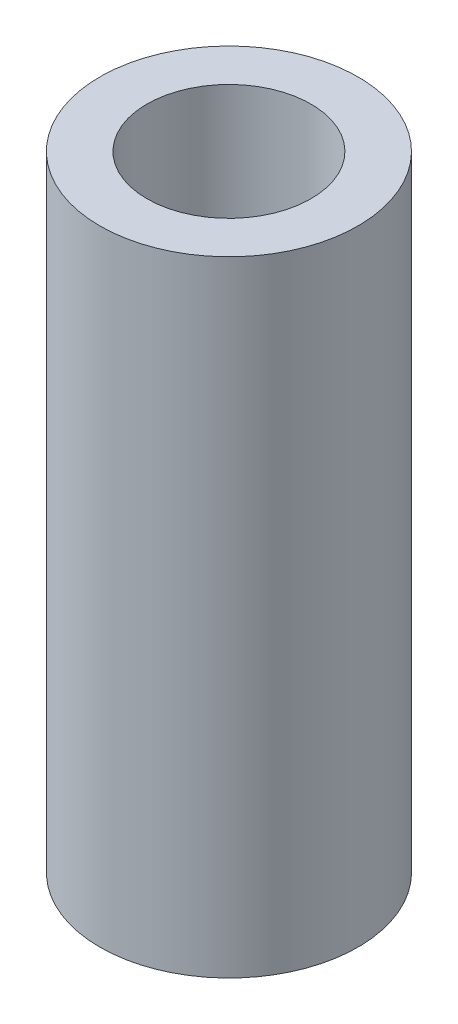
ISO-10303-21;
HEADER;
FILE_DESCRIPTION(('STEP AP214'),'2;1');
FILE_NAME('part.step','',(''),(''),'','','');
FILE_SCHEMA(('AUTOMOTIVE_DESIGN { 1 0 10303 214 1 1 1 1 }'));
ENDSEC;
DATA;
#1=APPLICATION_CONTEXT('core data for automotive mechanical design processes');
#2=APPLICATION_PROTOCOL_DEFINITION('international standard','automotive_design',2000,#1);
#3=PRODUCT_CONTEXT('',#1,'mechanical');
#4=PRODUCT('Part','Part','',(#3));
#5=PRODUCT_RELATED_PRODUCT_CATEGORY('part','',(#4));
#6=PRODUCT_DEFINITION_FORMATION('','',#4);
#7=PRODUCT_DEFINITION_CONTEXT('part definition',#1,'design');
#8=PRODUCT_DEFINITION('design','',#6,#7);
#9=PRODUCT_DEFINITION_SHAPE('','',#8);
#10=(LENGTH_UNIT() NAMED_UNIT(*) SI_UNIT(.MILLI.,.METRE.));
#11=(NAMED_UNIT(*) PLANE_ANGLE_UNIT() SI_UNIT($,.RADIAN.));
#12=(NAMED_UNIT(*) SI_UNIT($,.STERADIAN.) SOLID_ANGLE_UNIT());
#13=UNCERTAINTY_MEASURE_WITH_UNIT(LENGTH_MEASURE(1.E-05),#10,'distance_accuracy_value','');
#14=(GEOMETRIC_REPRESENTATION_CONTEXT(3) GLOBAL_UNCERTAINTY_ASSIGNED_CONTEXT((#13)) GLOBAL_UNIT_ASSIGNED_CONTEXT((#10,
#11,#12)) REPRESENTATION_CONTEXT('',''));
#15=CARTESIAN_POINT('',(0.,0.,0.));
#16=DIRECTION('',(0.,0.,1.));
#17=DIRECTION('',(1.,0.,0.));
#18=AXIS2_PLACEMENT_3D('',#15,#16,#17);
#19=CARTESIAN_POINT('',(0.,19.05,0.));
#20=DIRECTION('',(0.,1.,0.));
#21=DIRECTION('',(0.,0.,1.));
#22=AXIS2_PLACEMENT_3D('',#19,#20,#21);
#23=PLANE('',#22);
#24=CARTESIAN_POINT('',(0.,19.05,0.));
#25=DIRECTION('',(0.,1.,0.));
#26=DIRECTION('',(0.,0.,1.));
#27=AXIS2_PLACEMENT_3D('',#24,#25,#26);
#28=CIRCLE('',#27,3.937);
#29=CARTESIAN_POINT('',(0.,19.05,3.937));
#30=VERTEX_POINT('',#29);
#31=EDGE_CURVE('E10',#30,#30,#28,.T.);
#32=ORIENTED_EDGE('',*,*,#31,.T.);
#33=EDGE_LOOP('',(#32));
#34=FACE_BOUND('',#33,.T.);
#35=CARTESIAN_POINT('',(0.,19.05,0.));
#36=DIRECTION('',(0.,1.,0.));
#37=DIRECTION('',(0.,0.,1.));
#38=AXIS2_PLACEMENT_3D('',#35,#36,#37);
#39=CIRCLE('',#38,2.5019);
#40=CARTESIAN_POINT('',(0.,19.05,2.5019));
#41=VERTEX_POINT('',#40);
#42=EDGE_CURVE('E42',#41,#41,#39,.T.);
#43=ORIENTED_EDGE('',*,*,#42,.F.);
#44=EDGE_LOOP('',(#43));
#45=FACE_BOUND('',#44,.T.);
#46=ADVANCED_FACE('F31',(#34,#45),#23,.T.);
#47=CARTESIAN_POINT('',(0.,0.,0.));
#48=DIRECTION('',(0.,1.,0.));
#49=DIRECTION('',(0.,0.,1.));
#50=AXIS2_PLACEMENT_3D('',#47,#48,#49);
#51=PLANE('',#50);
#52=CARTESIAN_POINT('',(0.,0.,0.));
#53=DIRECTION('',(0.,1.,0.));
#54=DIRECTION('',(0.,0.,1.));
#55=AXIS2_PLACEMENT_3D('',#52,#53,#54);
#56=CIRCLE('',#55,3.937);
#57=CARTESIAN_POINT('',(0.,0.,3.937));
#58=VERTEX_POINT('',#57);
#59=EDGE_CURVE('E35',#58,#58,#56,.T.);
#60=ORIENTED_EDGE('',*,*,#59,.F.);
#61=EDGE_LOOP('',(#60));
#62=FACE_BOUND('',#61,.T.);
#63=CARTESIAN_POINT('',(0.,0.,0.));
#64=DIRECTION('',(0.,1.,0.));
#65=DIRECTION('',(0.,0.,1.));
#66=AXIS2_PLACEMENT_3D('',#63,#64,#65);
#67=CIRCLE('',#66,2.5019);
#68=CARTESIAN_POINT('',(0.,0.,2.5019));
#69=VERTEX_POINT('',#68);
#70=EDGE_CURVE('E44',#69,#69,#67,.T.);
#71=ORIENTED_EDGE('',*,*,#70,.T.);
#72=EDGE_LOOP('',(#71));
#73=FACE_BOUND('',#72,.T.);
#74=ADVANCED_FACE('F54',(#62,#73),#51,.F.);
#75=CARTESIAN_POINT('',(0.,19.05,0.));
#76=DIRECTION('',(0.,-1.,0.));
#77=DIRECTION('',(0.,0.,-1.));
#78=AXIS2_PLACEMENT_3D('',#75,#76,#77);
#79=CYLINDRICAL_SURFACE('',#78,3.937);
#80=ORIENTED_EDGE('',*,*,#31,.F.);
#81=EDGE_LOOP('',(#80));
#82=FACE_BOUND('',#81,.T.);
#83=ORIENTED_EDGE('',*,*,#59,.T.);
#84=EDGE_LOOP('',(#83));
#85=FACE_BOUND('',#84,.T.);
#86=ADVANCED_FACE('F33',(#82,#85),#79,.T.);
#87=CARTESIAN_POINT('',(0.,19.05,0.));
#88=DIRECTION('',(0.,-1.,0.));
#89=DIRECTION('',(0.,0.,-1.));
#90=AXIS2_PLACEMENT_3D('',#87,#88,#89);
#91=CYLINDRICAL_SURFACE('',#90,2.5019);
#92=ORIENTED_EDGE('',*,*,#42,.T.);
#93=EDGE_LOOP('',(#92));
#94=FACE_BOUND('',#93,.T.);
#95=ORIENTED_EDGE('',*,*,#70,.F.);
#96=EDGE_LOOP('',(#95));
#97=FACE_BOUND('',#96,.T.);
#98=ADVANCED_FACE('F50',(#94,#97),#91,.F.);
#99=CLOSED_SHELL('',(#46,#74,#86,#98));
#100=MANIFOLD_SOLID_BREP('B2',#99);
#101=ADVANCED_BREP_SHAPE_REPRESENTATION('',(#18,#100),#14);
#102=SHAPE_DEFINITION_REPRESENTATION(#9,#101);
ENDSEC;
END-ISO-10303-21;
